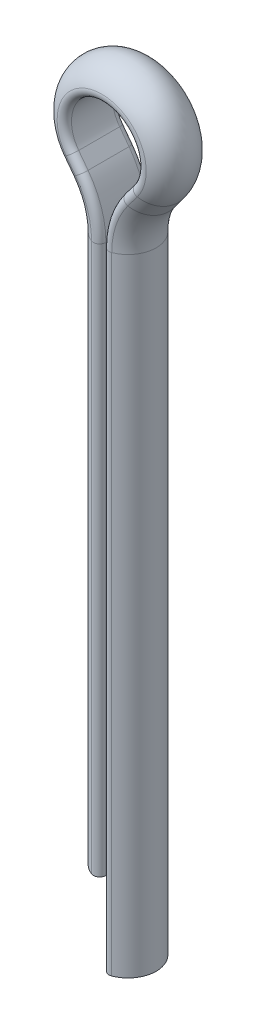
ISO-10303-21;
HEADER;
FILE_DESCRIPTION(('STEP AP214'),'2;1');
FILE_NAME('part.step','',(''),(''),'','','');
FILE_SCHEMA(('AUTOMOTIVE_DESIGN { 1 0 10303 214 1 1 1 1 }'));
ENDSEC;
DATA;
#1=APPLICATION_CONTEXT('core data for automotive mechanical design processes');
#2=APPLICATION_PROTOCOL_DEFINITION('international standard','automotive_design',2000,#1);
#3=PRODUCT_CONTEXT('',#1,'mechanical');
#4=PRODUCT('Part','Part','',(#3));
#5=PRODUCT_RELATED_PRODUCT_CATEGORY('part','',(#4));
#6=PRODUCT_DEFINITION_FORMATION('','',#4);
#7=PRODUCT_DEFINITION_CONTEXT('part definition',#1,'design');
#8=PRODUCT_DEFINITION('design','',#6,#7);
#9=PRODUCT_DEFINITION_SHAPE('','',#8);
#10=(LENGTH_UNIT() NAMED_UNIT(*) SI_UNIT(.MILLI.,.METRE.));
#11=(NAMED_UNIT(*) PLANE_ANGLE_UNIT() SI_UNIT($,.RADIAN.));
#12=(NAMED_UNIT(*) SI_UNIT($,.STERADIAN.) SOLID_ANGLE_UNIT());
#13=UNCERTAINTY_MEASURE_WITH_UNIT(LENGTH_MEASURE(1.E-05),#10,'distance_accuracy_value','');
#14=(GEOMETRIC_REPRESENTATION_CONTEXT(3) GLOBAL_UNCERTAINTY_ASSIGNED_CONTEXT((#13)) GLOBAL_UNIT_ASSIGNED_CONTEXT((#10,
#11,#12)) REPRESENTATION_CONTEXT('',''));
#15=CARTESIAN_POINT('',(0.,0.,0.));
#16=DIRECTION('',(0.,0.,1.));
#17=DIRECTION('',(1.,0.,0.));
#18=AXIS2_PLACEMENT_3D('',#15,#16,#17);
#19=CARTESIAN_POINT('',(0.,-2.5,0.));
#20=DIRECTION('',(0.,-1.,0.));
#21=DIRECTION('',(0.,0.,1.));
#22=AXIS2_PLACEMENT_3D('',#19,#20,#21);
#23=PLANE('',#22);
#24=DIRECTION('',(0.,0.,-1.));
#25=VECTOR('',#24,1.);
#26=CARTESIAN_POINT('',(0.0500000000000002,-2.5,-0.898610037780571));
#27=LINE('',#26,#25);
#28=CARTESIAN_POINT('',(0.0500000000000002,-2.5,0.653834841531101));
#29=VERTEX_POINT('',#28);
#30=CARTESIAN_POINT('',(0.0500000000000002,-2.5,-0.653834841531101));
#31=VERTEX_POINT('',#30);
#32=EDGE_CURVE('E161',#29,#31,#27,.T.);
#33=ORIENTED_EDGE('',*,*,#32,.T.);
#34=CARTESIAN_POINT('',(0.25,-2.5,-0.653834841531101));
#35=DIRECTION('',(0.,-1.,0.));
#36=DIRECTION('',(1.,0.,0.));
#37=AXIS2_PLACEMENT_3D('',#34,#35,#36);
#38=CIRCLE('',#37,0.2);
#39=CARTESIAN_POINT('',(0.321428571428572,-2.5,-0.840644796254273));
#40=VERTEX_POINT('',#39);
#41=EDGE_CURVE('E156',#31,#40,#38,.T.);
#42=ORIENTED_EDGE('',*,*,#41,.T.);
#43=CARTESIAN_POINT('',(0.,-2.5,0.));
#44=DIRECTION('',(0.,-1.,0.));
#45=DIRECTION('',(0.,0.,1.));
#46=AXIS2_PLACEMENT_3D('',#43,#44,#45);
#47=CIRCLE('',#46,0.9);
#48=CARTESIAN_POINT('',(0.321428571428572,-2.5,0.840644796254273));
#49=VERTEX_POINT('',#48);
#50=EDGE_CURVE('E158',#40,#49,#47,.T.);
#51=ORIENTED_EDGE('',*,*,#50,.T.);
#52=CARTESIAN_POINT('',(0.25,-2.5,0.653834841531101));
#53=DIRECTION('',(0.,-1.,0.));
#54=DIRECTION('',(1.,0.,0.));
#55=AXIS2_PLACEMENT_3D('',#52,#53,#54);
#56=CIRCLE('',#55,0.2);
#57=EDGE_CURVE('E167',#49,#29,#56,.T.);
#58=ORIENTED_EDGE('',*,*,#57,.T.);
#59=EDGE_LOOP('',(#33,#42,#51,#58));
#60=FACE_BOUND('',#59,.T.);
#61=ADVANCED_FACE('F39',(#60),#23,.T.);
#62=CARTESIAN_POINT('',(0.,0.,0.));
#63=DIRECTION('',(0.,1.,0.));
#64=DIRECTION('',(0.,0.,1.));
#65=AXIS2_PLACEMENT_3D('',#62,#63,#64);
#66=PLANE('',#65);
#67=CARTESIAN_POINT('',(0.,0.,0.));
#68=DIRECTION('',(0.,1.,0.));
#69=DIRECTION('',(0.,0.,1.));
#70=AXIS2_PLACEMENT_3D('',#67,#68,#69);
#71=CIRCLE('',#70,0.9);
#72=CARTESIAN_POINT('',(-0.321428571428571,0.,-0.840644796254273));
#73=VERTEX_POINT('',#72);
#74=CARTESIAN_POINT('',(-0.321428571428571,0.,0.840644796254273));
#75=VERTEX_POINT('',#74);
#76=EDGE_CURVE('E326',#73,#75,#71,.T.);
#77=ORIENTED_EDGE('',*,*,#76,.F.);
#78=CARTESIAN_POINT('',(-0.25,0.,-0.653834841531101));
#79=DIRECTION('',(0.,1.,0.));
#80=DIRECTION('',(0.,0.,1.));
#81=AXIS2_PLACEMENT_3D('',#78,#79,#80);
#82=CIRCLE('',#81,0.2);
#83=CARTESIAN_POINT('',(-0.0499999999999999,0.,-0.653834841531101));
#84=VERTEX_POINT('',#83);
#85=EDGE_CURVE('E57',#73,#84,#82,.F.);
#86=ORIENTED_EDGE('',*,*,#85,.T.);
#87=DIRECTION('',(0.,0.,-1.));
#88=VECTOR('',#87,1.);
#89=CARTESIAN_POINT('',(-0.0499999999999999,0.,-0.898610037780571));
#90=LINE('',#89,#88);
#91=CARTESIAN_POINT('',(-0.0499999999999999,0.,0.653834841531101));
#92=VERTEX_POINT('',#91);
#93=EDGE_CURVE('E192',#92,#84,#90,.T.);
#94=ORIENTED_EDGE('',*,*,#93,.F.);
#95=CARTESIAN_POINT('',(-0.25,0.,0.653834841531101));
#96=DIRECTION('',(0.,1.,0.));
#97=DIRECTION('',(0.,0.,1.));
#98=AXIS2_PLACEMENT_3D('',#95,#96,#97);
#99=CIRCLE('',#98,0.2);
#100=EDGE_CURVE('E265',#92,#75,#99,.F.);
#101=ORIENTED_EDGE('',*,*,#100,.T.);
#102=EDGE_LOOP('',(#77,#86,#94,#101));
#103=FACE_BOUND('',#102,.T.);
#104=ADVANCED_FACE('F325',(#103),#66,.F.);
#105=CARTESIAN_POINT('',(0.,-2.5,0.));
#106=DIRECTION('',(0.,1.,0.));
#107=DIRECTION('',(-1.,0.,0.));
#108=AXIS2_PLACEMENT_3D('',#105,#106,#107);
#109=CYLINDRICAL_SURFACE('',#108,0.9);
#110=ORIENTED_EDGE('',*,*,#50,.F.);
#111=DIRECTION('',(0.,1.,0.));
#112=VECTOR('',#111,1.);
#113=CARTESIAN_POINT('',(0.321428571428572,-2.5,-0.840644796254273));
#114=LINE('',#113,#112);
#115=CARTESIAN_POINT('',(0.321428571428575,17.5,-0.84064479625427));
#116=VERTEX_POINT('',#115);
#117=EDGE_CURVE('E173',#40,#116,#114,.T.);
#118=ORIENTED_EDGE('',*,*,#117,.T.);
#119=CARTESIAN_POINT('',(0.,17.5,0.));
#120=DIRECTION('',(0.,-1.,0.));
#121=DIRECTION('',(0.,0.,1.));
#122=AXIS2_PLACEMENT_3D('',#119,#120,#121);
#123=CIRCLE('',#122,0.9);
#124=CARTESIAN_POINT('',(0.321428571428589,17.5,0.840644796254258));
#125=VERTEX_POINT('',#124);
#126=EDGE_CURVE('E345',#116,#125,#123,.T.);
#127=ORIENTED_EDGE('',*,*,#126,.T.);
#128=DIRECTION('',(0.,1.,0.));
#129=VECTOR('',#128,1.);
#130=CARTESIAN_POINT('',(0.321428571428572,-2.5,0.840644796254273));
#131=LINE('',#130,#129);
#132=EDGE_CURVE('E176',#125,#49,#131,.F.);
#133=ORIENTED_EDGE('',*,*,#132,.T.);
#134=EDGE_LOOP('',(#110,#118,#127,#133));
#135=FACE_BOUND('',#134,.T.);
#136=ADVANCED_FACE('F171',(#135),#109,.T.);
#137=CARTESIAN_POINT('',(0.0500000000000002,-2.5,-0.898610037780571));
#138=DIRECTION('',(1.,0.,0.));
#139=DIRECTION('',(0.,1.,0.));
#140=AXIS2_PLACEMENT_3D('',#137,#138,#139);
#141=PLANE('',#140);
#142=DIRECTION('',(0.,0.,-1.));
#143=VECTOR('',#142,1.);
#144=CARTESIAN_POINT('',(0.0500000000000001,17.5,-0.898610037780571));
#145=LINE('',#144,#143);
#146=CARTESIAN_POINT('',(0.0500000000000001,17.5,0.653834841531101));
#147=VERTEX_POINT('',#146);
#148=CARTESIAN_POINT('',(0.0500000000000001,17.5,-0.653834841531101));
#149=VERTEX_POINT('',#148);
#150=EDGE_CURVE('E346',#147,#149,#145,.T.);
#151=ORIENTED_EDGE('',*,*,#150,.T.);
#152=DIRECTION('',(0.,1.,0.));
#153=VECTOR('',#152,1.);
#154=CARTESIAN_POINT('',(0.0500000000000002,-2.5,-0.653834841531101));
#155=LINE('',#154,#153);
#156=EDGE_CURVE('E190',#149,#31,#155,.F.);
#157=ORIENTED_EDGE('',*,*,#156,.T.);
#158=ORIENTED_EDGE('',*,*,#32,.F.);
#159=DIRECTION('',(0.,1.,0.));
#160=VECTOR('',#159,1.);
#161=CARTESIAN_POINT('',(0.0500000000000002,-2.5,0.653834841531101));
#162=LINE('',#161,#160);
#163=EDGE_CURVE('E185',#29,#147,#162,.T.);
#164=ORIENTED_EDGE('',*,*,#163,.T.);
#165=EDGE_LOOP('',(#151,#157,#158,#164));
#166=FACE_BOUND('',#165,.T.);
#167=ADVANCED_FACE('F402',(#166),#141,.F.);
#168=CARTESIAN_POINT('',(2.9,17.5,0.));
#169=DIRECTION('',(0.,0.,-1.));
#170=DIRECTION('',(-1.,0.,0.));
#171=AXIS2_PLACEMENT_3D('',#168,#169,#170);
#172=TOROIDAL_SURFACE('',#171,2.9,0.9);
#173=ORIENTED_EDGE('',*,*,#126,.F.);
#174=CARTESIAN_POINT('',(2.9,17.5,-0.84064479625427));
#175=DIRECTION('',(0.,0.,1.));
#176=DIRECTION('',(1.,0.,0.));
#177=AXIS2_PLACEMENT_3D('',#174,#175,#176);
#178=CIRCLE('',#177,2.57857142857143);
#179=CARTESIAN_POINT('',(0.837142857142857,19.0471428571429,-0.840644796254273));
#180=VERTEX_POINT('',#179);
#181=EDGE_CURVE('E202',#116,#180,#178,.F.);
#182=ORIENTED_EDGE('',*,*,#181,.T.);
#183=CARTESIAN_POINT('',(0.58,19.24,0.));
#184=DIRECTION('',(-0.6,-0.8,0.));
#185=DIRECTION('',(0.,0.,1.));
#186=AXIS2_PLACEMENT_3D('',#183,#184,#185);
#187=CIRCLE('',#186,0.9);
#188=CARTESIAN_POINT('',(0.837142857142857,19.0471428571429,0.840644796254273));
#189=VERTEX_POINT('',#188);
#190=EDGE_CURVE('E350',#180,#189,#187,.T.);
#191=ORIENTED_EDGE('',*,*,#190,.T.);
#192=CARTESIAN_POINT('',(2.9,17.5,0.840644796254258));
#193=DIRECTION('',(0.,0.,-1.));
#194=DIRECTION('',(-1.,0.,0.));
#195=AXIS2_PLACEMENT_3D('',#192,#193,#194);
#196=CIRCLE('',#195,2.57857142857143);
#197=EDGE_CURVE('E166',#189,#125,#196,.F.);
#198=ORIENTED_EDGE('',*,*,#197,.T.);
#199=EDGE_LOOP('',(#173,#182,#191,#198));
#200=FACE_BOUND('',#199,.T.);
#201=ADVANCED_FACE('F409',(#200),#172,.T.);
#202=CARTESIAN_POINT('',(2.9,17.5,0.));
#203=DIRECTION('',(0.,0.,-1.));
#204=DIRECTION('',(-1.,0.,0.));
#205=AXIS2_PLACEMENT_3D('',#202,#203,#204);
#206=CYLINDRICAL_SURFACE('',#205,2.85);
#207=DIRECTION('',(0.,0.,-1.));
#208=VECTOR('',#207,1.);
#209=CARTESIAN_POINT('',(0.62,19.21,-0.898610037780571));
#210=LINE('',#209,#208);
#211=CARTESIAN_POINT('',(0.62,19.21,0.653834841531101));
#212=VERTEX_POINT('',#211);
#213=CARTESIAN_POINT('',(0.62,19.21,-0.653834841531101));
#214=VERTEX_POINT('',#213);
#215=EDGE_CURVE('E351',#212,#214,#210,.T.);
#216=ORIENTED_EDGE('',*,*,#215,.T.);
#217=CARTESIAN_POINT('',(2.9,17.5,-0.653834841531101));
#218=DIRECTION('',(0.,0.,1.));
#219=DIRECTION('',(1.,0.,0.));
#220=AXIS2_PLACEMENT_3D('',#217,#218,#219);
#221=CIRCLE('',#220,2.85);
#222=EDGE_CURVE('E208',#214,#149,#221,.T.);
#223=ORIENTED_EDGE('',*,*,#222,.T.);
#224=ORIENTED_EDGE('',*,*,#150,.F.);
#225=CARTESIAN_POINT('',(2.9,17.5,0.653834841531101));
#226=DIRECTION('',(0.,0.,1.));
#227=DIRECTION('',(1.,0.,0.));
#228=AXIS2_PLACEMENT_3D('',#225,#226,#227);
#229=CIRCLE('',#228,2.85);
#230=EDGE_CURVE('E205',#147,#212,#229,.F.);
#231=ORIENTED_EDGE('',*,*,#230,.T.);
#232=EDGE_LOOP('',(#216,#223,#224,#231));
#233=FACE_BOUND('',#232,.T.);
#234=ADVANCED_FACE('F403',(#233),#206,.T.);
#235=CARTESIAN_POINT('',(0.580000000000003,19.24,0.));
#236=DIRECTION('',(0.600000000000004,0.799999999999997,0.));
#237=DIRECTION('',(-0.799999999999997,0.600000000000004,0.));
#238=AXIS2_PLACEMENT_3D('',#235,#236,#237);
#239=CYLINDRICAL_SURFACE('',#238,0.9);
#240=ORIENTED_EDGE('',*,*,#190,.F.);
#241=DIRECTION('',(0.600000000000004,0.799999999999997,0.));
#242=VECTOR('',#241,1.);
#243=CARTESIAN_POINT('',(0.837142857142859,19.0471428571429,-0.840644796254273));
#244=LINE('',#243,#242);
#245=CARTESIAN_POINT('',(1.13714285714286,19.4471428571429,-0.840644796254274));
#246=VERTEX_POINT('',#245);
#247=EDGE_CURVE('E214',#180,#246,#244,.T.);
#248=ORIENTED_EDGE('',*,*,#247,.T.);
#249=CARTESIAN_POINT('',(0.880000000000003,19.64,0.));
#250=DIRECTION('',(-0.600000000000004,-0.799999999999997,0.));
#251=DIRECTION('',(0.,0.,1.));
#252=AXIS2_PLACEMENT_3D('',#249,#250,#251);
#253=CIRCLE('',#252,0.9);
#254=CARTESIAN_POINT('',(1.13714285714285,19.4471428571429,0.840644796254274));
#255=VERTEX_POINT('',#254);
#256=EDGE_CURVE('E355',#246,#255,#253,.T.);
#257=ORIENTED_EDGE('',*,*,#256,.T.);
#258=DIRECTION('',(0.600000000000004,0.799999999999997,0.));
#259=VECTOR('',#258,1.);
#260=CARTESIAN_POINT('',(0.837142857142859,19.0471428571429,0.840644796254273));
#261=LINE('',#260,#259);
#262=EDGE_CURVE('E211',#255,#189,#261,.F.);
#263=ORIENTED_EDGE('',*,*,#262,.T.);
#264=EDGE_LOOP('',(#240,#248,#257,#263));
#265=FACE_BOUND('',#264,.T.);
#266=ADVANCED_FACE('F412',(#265),#239,.T.);
#267=CARTESIAN_POINT('',(0.620000000000003,19.21,-0.898610037780571));
#268=DIRECTION('',(0.799999999999997,-0.600000000000004,0.));
#269=DIRECTION('',(0.600000000000004,0.799999999999997,0.));
#270=AXIS2_PLACEMENT_3D('',#267,#268,#269);
#271=PLANE('',#270);
#272=DIRECTION('',(0.,0.,-1.));
#273=VECTOR('',#272,1.);
#274=CARTESIAN_POINT('',(0.920000000000003,19.61,-0.898610037780571));
#275=LINE('',#274,#273);
#276=CARTESIAN_POINT('',(0.920000000000003,19.61,0.653834841531103));
#277=VERTEX_POINT('',#276);
#278=CARTESIAN_POINT('',(0.920000000000003,19.61,-0.653834841531103));
#279=VERTEX_POINT('',#278);
#280=EDGE_CURVE('E356',#277,#279,#275,.T.);
#281=ORIENTED_EDGE('',*,*,#280,.T.);
#282=DIRECTION('',(0.600000000000004,0.799999999999997,0.));
#283=VECTOR('',#282,1.);
#284=CARTESIAN_POINT('',(0.620000000000003,19.21,-0.653834841531101));
#285=LINE('',#284,#283);
#286=EDGE_CURVE('E220',#279,#214,#285,.F.);
#287=ORIENTED_EDGE('',*,*,#286,.T.);
#288=ORIENTED_EDGE('',*,*,#215,.F.);
#289=DIRECTION('',(0.600000000000004,0.799999999999997,0.));
#290=VECTOR('',#289,1.);
#291=CARTESIAN_POINT('',(0.620000000000003,19.21,0.653834841531101));
#292=LINE('',#291,#290);
#293=EDGE_CURVE('E217',#212,#277,#292,.T.);
#294=ORIENTED_EDGE('',*,*,#293,.T.);
#295=EDGE_LOOP('',(#281,#287,#288,#294));
#296=FACE_BOUND('',#295,.T.);
#297=ADVANCED_FACE('F581',(#296),#271,.F.);
#298=CARTESIAN_POINT('',(0.,20.3,0.));
#299=DIRECTION('',(0.,0.,1.));
#300=DIRECTION('',(1.,0.,0.));
#301=AXIS2_PLACEMENT_3D('',#298,#299,#300);
#302=TOROIDAL_SURFACE('',#301,1.1,0.9);
#303=ORIENTED_EDGE('',*,*,#256,.F.);
#304=CARTESIAN_POINT('',(0.,20.3,-0.840644796254274));
#305=DIRECTION('',(0.,0.,1.));
#306=DIRECTION('',(1.,0.,0.));
#307=AXIS2_PLACEMENT_3D('',#304,#305,#306);
#308=CIRCLE('',#307,1.42142857142857);
#309=CARTESIAN_POINT('',(-1.13714285714285,19.4471428571429,-0.840644796254273));
#310=VERTEX_POINT('',#309);
#311=EDGE_CURVE('E226',#246,#310,#308,.T.);
#312=ORIENTED_EDGE('',*,*,#311,.T.);
#313=CARTESIAN_POINT('',(-0.880000000000001,19.64,0.));
#314=DIRECTION('',(-0.6,0.8,0.));
#315=DIRECTION('',(0.,0.,1.));
#316=AXIS2_PLACEMENT_3D('',#313,#314,#315);
#317=CIRCLE('',#316,0.9);
#318=CARTESIAN_POINT('',(-1.13714285714286,19.4471428571429,0.840644796254273));
#319=VERTEX_POINT('',#318);
#320=EDGE_CURVE('E360',#310,#319,#317,.T.);
#321=ORIENTED_EDGE('',*,*,#320,.T.);
#322=CARTESIAN_POINT('',(0.,20.3,0.840644796254274));
#323=DIRECTION('',(0.,0.,-1.));
#324=DIRECTION('',(-1.,0.,0.));
#325=AXIS2_PLACEMENT_3D('',#322,#323,#324);
#326=CIRCLE('',#325,1.42142857142857);
#327=EDGE_CURVE('E223',#319,#255,#326,.T.);
#328=ORIENTED_EDGE('',*,*,#327,.T.);
#329=EDGE_LOOP('',(#303,#312,#321,#328));
#330=FACE_BOUND('',#329,.T.);
#331=ADVANCED_FACE('F426',(#330),#302,.T.);
#332=CARTESIAN_POINT('',(0.,20.3,0.));
#333=DIRECTION('',(0.,0.,1.));
#334=DIRECTION('',(1.,0.,0.));
#335=AXIS2_PLACEMENT_3D('',#332,#333,#334);
#336=CYLINDRICAL_SURFACE('',#335,1.15);
#337=DIRECTION('',(0.,0.,-1.));
#338=VECTOR('',#337,1.);
#339=CARTESIAN_POINT('',(-0.920000000000001,19.61,-0.898610037780571));
#340=LINE('',#339,#338);
#341=CARTESIAN_POINT('',(-0.920000000000001,19.61,0.653834841531101));
#342=VERTEX_POINT('',#341);
#343=CARTESIAN_POINT('',(-0.920000000000001,19.61,-0.653834841531101));
#344=VERTEX_POINT('',#343);
#345=EDGE_CURVE('E361',#342,#344,#340,.T.);
#346=ORIENTED_EDGE('',*,*,#345,.T.);
#347=CARTESIAN_POINT('',(0.,20.3,-0.653834841531103));
#348=DIRECTION('',(0.,0.,-1.));
#349=DIRECTION('',(-1.,0.,0.));
#350=AXIS2_PLACEMENT_3D('',#347,#348,#349);
#351=CIRCLE('',#350,1.15);
#352=EDGE_CURVE('E232',#344,#279,#351,.T.);
#353=ORIENTED_EDGE('',*,*,#352,.T.);
#354=ORIENTED_EDGE('',*,*,#280,.F.);
#355=CARTESIAN_POINT('',(0.,20.3,0.653834841531103));
#356=DIRECTION('',(0.,0.,-1.));
#357=DIRECTION('',(-1.,0.,0.));
#358=AXIS2_PLACEMENT_3D('',#355,#356,#357);
#359=CIRCLE('',#358,1.15);
#360=EDGE_CURVE('E229',#277,#342,#359,.F.);
#361=ORIENTED_EDGE('',*,*,#360,.T.);
#362=EDGE_LOOP('',(#346,#353,#354,#361));
#363=FACE_BOUND('',#362,.T.);
#364=ADVANCED_FACE('F563',(#363),#336,.F.);
#365=CARTESIAN_POINT('',(-0.879999999999999,19.64,0.));
#366=DIRECTION('',(0.600000000000001,-0.799999999999999,0.));
#367=DIRECTION('',(0.799999999999999,0.600000000000001,0.));
#368=AXIS2_PLACEMENT_3D('',#365,#366,#367);
#369=CYLINDRICAL_SURFACE('',#368,0.9);
#370=ORIENTED_EDGE('',*,*,#320,.F.);
#371=DIRECTION('',(0.600000000000001,-0.799999999999999,0.));
#372=VECTOR('',#371,1.);
#373=CARTESIAN_POINT('',(-1.13714285714286,19.4471428571429,-0.840644796254273));
#374=LINE('',#373,#372);
#375=CARTESIAN_POINT('',(-0.837142857142864,19.0471428571429,-0.840644796254265));
#376=VERTEX_POINT('',#375);
#377=EDGE_CURVE('E238',#310,#376,#374,.T.);
#378=ORIENTED_EDGE('',*,*,#377,.T.);
#379=CARTESIAN_POINT('',(-0.580000000000001,19.24,0.));
#380=DIRECTION('',(-0.600000000000001,0.799999999999999,0.));
#381=DIRECTION('',(0.,0.,1.));
#382=AXIS2_PLACEMENT_3D('',#379,#380,#381);
#383=CIRCLE('',#382,0.9);
#384=CARTESIAN_POINT('',(-0.83714285714286,19.0471428571429,0.840644796254271));
#385=VERTEX_POINT('',#384);
#386=EDGE_CURVE('E365',#376,#385,#383,.T.);
#387=ORIENTED_EDGE('',*,*,#386,.T.);
#388=DIRECTION('',(0.600000000000001,-0.799999999999999,0.));
#389=VECTOR('',#388,1.);
#390=CARTESIAN_POINT('',(-1.13714285714286,19.4471428571429,0.840644796254273));
#391=LINE('',#390,#389);
#392=EDGE_CURVE('E235',#385,#319,#391,.F.);
#393=ORIENTED_EDGE('',*,*,#392,.T.);
#394=EDGE_LOOP('',(#370,#378,#387,#393));
#395=FACE_BOUND('',#394,.T.);
#396=ADVANCED_FACE('F429',(#395),#369,.T.);
#397=CARTESIAN_POINT('',(-0.919999999999999,19.61,-0.898610037780571));
#398=DIRECTION('',(-0.799999999999999,-0.600000000000001,0.));
#399=DIRECTION('',(0.600000000000001,-0.799999999999999,0.));
#400=AXIS2_PLACEMENT_3D('',#397,#398,#399);
#401=PLANE('',#400);
#402=DIRECTION('',(0.,0.,-1.));
#403=VECTOR('',#402,1.);
#404=CARTESIAN_POINT('',(-0.620000000000001,19.21,-0.898610037780571));
#405=LINE('',#404,#403);
#406=CARTESIAN_POINT('',(-0.620000000000001,19.21,0.653834841531101));
#407=VERTEX_POINT('',#406);
#408=CARTESIAN_POINT('',(-0.620000000000001,19.21,-0.653834841531102));
#409=VERTEX_POINT('',#408);
#410=EDGE_CURVE('E366',#407,#409,#405,.T.);
#411=ORIENTED_EDGE('',*,*,#410,.T.);
#412=DIRECTION('',(0.600000000000001,-0.799999999999999,0.));
#413=VECTOR('',#412,1.);
#414=CARTESIAN_POINT('',(-0.919999999999999,19.61,-0.653834841531101));
#415=LINE('',#414,#413);
#416=EDGE_CURVE('E244',#409,#344,#415,.F.);
#417=ORIENTED_EDGE('',*,*,#416,.T.);
#418=ORIENTED_EDGE('',*,*,#345,.F.);
#419=DIRECTION('',(0.600000000000001,-0.799999999999999,0.));
#420=VECTOR('',#419,1.);
#421=CARTESIAN_POINT('',(-0.919999999999999,19.61,0.653834841531101));
#422=LINE('',#421,#420);
#423=EDGE_CURVE('E241',#342,#407,#422,.T.);
#424=ORIENTED_EDGE('',*,*,#423,.T.);
#425=EDGE_LOOP('',(#411,#417,#418,#424));
#426=FACE_BOUND('',#425,.T.);
#427=ADVANCED_FACE('F453',(#426),#401,.F.);
#428=CARTESIAN_POINT('',(-2.9,17.5,0.));
#429=DIRECTION('',(0.,0.,-1.));
#430=DIRECTION('',(-1.,0.,0.));
#431=AXIS2_PLACEMENT_3D('',#428,#429,#430);
#432=TOROIDAL_SURFACE('',#431,2.9,0.9);
#433=ORIENTED_EDGE('',*,*,#386,.F.);
#434=CARTESIAN_POINT('',(-2.9,17.5,-0.840644796254265));
#435=DIRECTION('',(0.,0.,1.));
#436=DIRECTION('',(1.,0.,0.));
#437=AXIS2_PLACEMENT_3D('',#434,#435,#436);
#438=CIRCLE('',#437,2.57857142857143);
#439=CARTESIAN_POINT('',(-0.321428571428571,17.5,-0.840644796254273));
#440=VERTEX_POINT('',#439);
#441=EDGE_CURVE('E250',#376,#440,#438,.F.);
#442=ORIENTED_EDGE('',*,*,#441,.T.);
#443=CARTESIAN_POINT('',(0.,17.5,0.));
#444=DIRECTION('',(0.,1.,0.));
#445=DIRECTION('',(0.,0.,1.));
#446=AXIS2_PLACEMENT_3D('',#443,#444,#445);
#447=CIRCLE('',#446,0.9);
#448=CARTESIAN_POINT('',(-0.321428571428571,17.5,0.840644796254273));
#449=VERTEX_POINT('',#448);
#450=EDGE_CURVE('E338',#440,#449,#447,.T.);
#451=ORIENTED_EDGE('',*,*,#450,.T.);
#452=CARTESIAN_POINT('',(-2.9,17.5,0.840644796254271));
#453=DIRECTION('',(0.,0.,-1.));
#454=DIRECTION('',(-1.,0.,0.));
#455=AXIS2_PLACEMENT_3D('',#452,#453,#454);
#456=CIRCLE('',#455,2.57857142857143);
#457=EDGE_CURVE('E247',#449,#385,#456,.F.);
#458=ORIENTED_EDGE('',*,*,#457,.T.);
#459=EDGE_LOOP('',(#433,#442,#451,#458));
#460=FACE_BOUND('',#459,.T.);
#461=ADVANCED_FACE('F439',(#460),#432,.T.);
#462=CARTESIAN_POINT('',(-2.9,17.5,0.));
#463=DIRECTION('',(0.,0.,-1.));
#464=DIRECTION('',(-1.,0.,0.));
#465=AXIS2_PLACEMENT_3D('',#462,#463,#464);
#466=CYLINDRICAL_SURFACE('',#465,2.85);
#467=DIRECTION('',(0.,0.,-1.));
#468=VECTOR('',#467,1.);
#469=CARTESIAN_POINT('',(-0.0499999999999988,17.5,-0.898610037780571));
#470=LINE('',#469,#468);
#471=CARTESIAN_POINT('',(-0.0499999999999988,17.5,0.653834841531101));
#472=VERTEX_POINT('',#471);
#473=CARTESIAN_POINT('',(-0.0499999999999988,17.5,-0.653834841531101));
#474=VERTEX_POINT('',#473);
#475=EDGE_CURVE('E333',#472,#474,#470,.T.);
#476=ORIENTED_EDGE('',*,*,#475,.T.);
#477=CARTESIAN_POINT('',(-2.9,17.5,-0.653834841531102));
#478=DIRECTION('',(0.,0.,1.));
#479=DIRECTION('',(1.,0.,0.));
#480=AXIS2_PLACEMENT_3D('',#477,#478,#479);
#481=CIRCLE('',#480,2.85);
#482=EDGE_CURVE('E256',#474,#409,#481,.T.);
#483=ORIENTED_EDGE('',*,*,#482,.T.);
#484=ORIENTED_EDGE('',*,*,#410,.F.);
#485=CARTESIAN_POINT('',(-2.9,17.5,0.653834841531102));
#486=DIRECTION('',(0.,0.,1.));
#487=DIRECTION('',(1.,0.,0.));
#488=AXIS2_PLACEMENT_3D('',#485,#486,#487);
#489=CIRCLE('',#488,2.85);
#490=EDGE_CURVE('E253',#407,#472,#489,.F.);
#491=ORIENTED_EDGE('',*,*,#490,.T.);
#492=EDGE_LOOP('',(#476,#483,#484,#491));
#493=FACE_BOUND('',#492,.T.);
#494=ADVANCED_FACE('F445',(#493),#466,.T.);
#495=CARTESIAN_POINT('',(0.,17.5,0.));
#496=DIRECTION('',(0.,-1.,0.));
#497=DIRECTION('',(0.,0.,-1.));
#498=AXIS2_PLACEMENT_3D('',#495,#496,#497);
#499=CYLINDRICAL_SURFACE('',#498,0.9);
#500=ORIENTED_EDGE('',*,*,#450,.F.);
#501=DIRECTION('',(0.,-1.,0.));
#502=VECTOR('',#501,1.);
#503=CARTESIAN_POINT('',(-0.321428571428571,17.5,-0.840644796254273));
#504=LINE('',#503,#502);
#505=EDGE_CURVE('E262',#440,#73,#504,.T.);
#506=ORIENTED_EDGE('',*,*,#505,.T.);
#507=ORIENTED_EDGE('',*,*,#76,.T.);
#508=DIRECTION('',(0.,-1.,0.));
#509=VECTOR('',#508,1.);
#510=CARTESIAN_POINT('',(-0.321428571428571,17.5,0.840644796254273));
#511=LINE('',#510,#509);
#512=EDGE_CURVE('E259',#75,#449,#511,.F.);
#513=ORIENTED_EDGE('',*,*,#512,.T.);
#514=EDGE_LOOP('',(#500,#506,#507,#513));
#515=FACE_BOUND('',#514,.T.);
#516=ADVANCED_FACE('F329',(#515),#499,.T.);
#517=CARTESIAN_POINT('',(-0.0499999999999999,17.5,-0.898610037780571));
#518=DIRECTION('',(-1.,0.,0.));
#519=DIRECTION('',(0.,0.,1.));
#520=AXIS2_PLACEMENT_3D('',#517,#518,#519);
#521=PLANE('',#520);
#522=ORIENTED_EDGE('',*,*,#93,.T.);
#523=DIRECTION('',(0.,-1.,0.));
#524=VECTOR('',#523,1.);
#525=CARTESIAN_POINT('',(-0.0499999999999999,17.5,-0.653834841531101));
#526=LINE('',#525,#524);
#527=EDGE_CURVE('E11',#84,#474,#526,.F.);
#528=ORIENTED_EDGE('',*,*,#527,.T.);
#529=ORIENTED_EDGE('',*,*,#475,.F.);
#530=DIRECTION('',(0.,-1.,0.));
#531=VECTOR('',#530,1.);
#532=CARTESIAN_POINT('',(-0.0499999999999999,17.5,0.653834841531101));
#533=LINE('',#532,#531);
#534=EDGE_CURVE('E49',#472,#92,#533,.T.);
#535=ORIENTED_EDGE('',*,*,#534,.T.);
#536=EDGE_LOOP('',(#522,#528,#529,#535));
#537=FACE_BOUND('',#536,.T.);
#538=ADVANCED_FACE('F443',(#537),#521,.F.);
#539=CARTESIAN_POINT('',(-0.25,17.5,-0.653834841531101));
#540=DIRECTION('',(0.,-1.,0.));
#541=DIRECTION('',(0.,0.,-1.));
#542=AXIS2_PLACEMENT_3D('',#539,#540,#541);
#543=CYLINDRICAL_SURFACE('',#542,0.2);
#544=ORIENTED_EDGE('',*,*,#85,.F.);
#545=ORIENTED_EDGE('',*,*,#505,.F.);
#546=CARTESIAN_POINT('',(-0.25,17.5,-0.653834841531101));
#547=DIRECTION('',(0.,1.,0.));
#548=DIRECTION('',(0.,0.,1.));
#549=AXIS2_PLACEMENT_3D('',#546,#547,#548);
#550=CIRCLE('',#549,0.2);
#551=EDGE_CURVE('E178',#474,#440,#550,.T.);
#552=ORIENTED_EDGE('',*,*,#551,.F.);
#553=ORIENTED_EDGE('',*,*,#527,.F.);
#554=EDGE_LOOP('',(#544,#545,#552,#553));
#555=FACE_BOUND('',#554,.T.);
#556=ADVANCED_FACE('F441',(#555),#543,.T.);
#557=CARTESIAN_POINT('',(-2.9,17.5,-0.653834841531102));
#558=DIRECTION('',(0.,0.,1.));
#559=DIRECTION('',(1.,0.,0.));
#560=AXIS2_PLACEMENT_3D('',#557,#558,#559);
#561=TOROIDAL_SURFACE('',#560,2.65,0.2);
#562=ORIENTED_EDGE('',*,*,#551,.T.);
#563=ORIENTED_EDGE('',*,*,#441,.F.);
#564=CARTESIAN_POINT('',(-0.780000000000002,19.09,-0.653834841531102));
#565=DIRECTION('',(-0.600000000000007,0.799999999999994,0.));
#566=DIRECTION('',(-0.799999999999995,-0.600000000000007,0.));
#567=AXIS2_PLACEMENT_3D('',#564,#565,#566);
#568=CIRCLE('',#567,0.2);
#569=EDGE_CURVE('E286',#409,#376,#568,.T.);
#570=ORIENTED_EDGE('',*,*,#569,.F.);
#571=ORIENTED_EDGE('',*,*,#482,.F.);
#572=EDGE_LOOP('',(#562,#563,#570,#571));
#573=FACE_BOUND('',#572,.T.);
#574=ADVANCED_FACE('F436',(#573),#561,.T.);
#575=CARTESIAN_POINT('',(-1.08,19.49,-0.653834841531101));
#576=DIRECTION('',(0.600000000000001,-0.799999999999999,0.));
#577=DIRECTION('',(0.799999999999999,0.600000000000001,0.));
#578=AXIS2_PLACEMENT_3D('',#575,#576,#577);
#579=CYLINDRICAL_SURFACE('',#578,0.2);
#580=ORIENTED_EDGE('',*,*,#569,.T.);
#581=ORIENTED_EDGE('',*,*,#377,.F.);
#582=CARTESIAN_POINT('',(-1.08,19.49,-0.653834841531101));
#583=DIRECTION('',(-0.599999999999996,0.800000000000003,0.));
#584=DIRECTION('',(-0.800000000000003,-0.599999999999996,0.));
#585=AXIS2_PLACEMENT_3D('',#582,#583,#584);
#586=CIRCLE('',#585,0.2);
#587=EDGE_CURVE('E282',#344,#310,#586,.T.);
#588=ORIENTED_EDGE('',*,*,#587,.F.);
#589=ORIENTED_EDGE('',*,*,#416,.F.);
#590=EDGE_LOOP('',(#580,#581,#588,#589));
#591=FACE_BOUND('',#590,.T.);
#592=ADVANCED_FACE('F431',(#591),#579,.T.);
#593=CARTESIAN_POINT('',(0.,20.3,-0.653834841531103));
#594=DIRECTION('',(0.,0.,-1.));
#595=DIRECTION('',(-1.,0.,0.));
#596=AXIS2_PLACEMENT_3D('',#593,#594,#595);
#597=TOROIDAL_SURFACE('',#596,1.35,0.2);
#598=ORIENTED_EDGE('',*,*,#587,.T.);
#599=ORIENTED_EDGE('',*,*,#311,.F.);
#600=CARTESIAN_POINT('',(1.08,19.49,-0.653834841531103));
#601=DIRECTION('',(-0.599999999999994,-0.800000000000004,0.));
#602=DIRECTION('',(0.800000000000004,-0.599999999999994,0.));
#603=AXIS2_PLACEMENT_3D('',#600,#601,#602);
#604=CIRCLE('',#603,0.2);
#605=EDGE_CURVE('E278',#279,#246,#604,.T.);
#606=ORIENTED_EDGE('',*,*,#605,.F.);
#607=ORIENTED_EDGE('',*,*,#352,.F.);
#608=EDGE_LOOP('',(#598,#599,#606,#607));
#609=FACE_BOUND('',#608,.T.);
#610=ADVANCED_FACE('F422',(#609),#597,.T.);
#611=CARTESIAN_POINT('',(0.780000000000002,19.09,-0.653834841531101));
#612=DIRECTION('',(0.600000000000004,0.799999999999997,0.));
#613=DIRECTION('',(-0.799999999999997,0.600000000000004,0.));
#614=AXIS2_PLACEMENT_3D('',#611,#612,#613);
#615=CYLINDRICAL_SURFACE('',#614,0.2);
#616=ORIENTED_EDGE('',*,*,#605,.T.);
#617=ORIENTED_EDGE('',*,*,#247,.F.);
#618=CARTESIAN_POINT('',(0.779999999999999,19.09,-0.653834841531101));
#619=DIRECTION('',(-0.600000000000008,-0.799999999999994,0.));
#620=DIRECTION('',(0.799999999999994,-0.600000000000008,0.));
#621=AXIS2_PLACEMENT_3D('',#618,#619,#620);
#622=CIRCLE('',#621,0.2);
#623=EDGE_CURVE('E274',#214,#180,#622,.T.);
#624=ORIENTED_EDGE('',*,*,#623,.F.);
#625=ORIENTED_EDGE('',*,*,#286,.F.);
#626=EDGE_LOOP('',(#616,#617,#624,#625));
#627=FACE_BOUND('',#626,.T.);
#628=ADVANCED_FACE('F416',(#627),#615,.T.);
#629=CARTESIAN_POINT('',(2.9,17.5,-0.653834841531101));
#630=DIRECTION('',(0.,0.,1.));
#631=DIRECTION('',(1.,0.,0.));
#632=AXIS2_PLACEMENT_3D('',#629,#630,#631);
#633=TOROIDAL_SURFACE('',#632,2.65,0.2);
#634=ORIENTED_EDGE('',*,*,#623,.T.);
#635=ORIENTED_EDGE('',*,*,#181,.F.);
#636=CARTESIAN_POINT('',(0.25,17.5,-0.653834841531101));
#637=DIRECTION('',(0.,-1.,0.));
#638=DIRECTION('',(0.,0.,-1.));
#639=AXIS2_PLACEMENT_3D('',#636,#637,#638);
#640=CIRCLE('',#639,0.2);
#641=EDGE_CURVE('E182',#149,#116,#640,.T.);
#642=ORIENTED_EDGE('',*,*,#641,.F.);
#643=ORIENTED_EDGE('',*,*,#222,.F.);
#644=EDGE_LOOP('',(#634,#635,#642,#643));
#645=FACE_BOUND('',#644,.T.);
#646=ADVANCED_FACE('F407',(#645),#633,.T.);
#647=CARTESIAN_POINT('',(0.25,-2.5,-0.653834841531101));
#648=DIRECTION('',(0.,1.,0.));
#649=DIRECTION('',(-1.,0.,0.));
#650=AXIS2_PLACEMENT_3D('',#647,#648,#649);
#651=CYLINDRICAL_SURFACE('',#650,0.2);
#652=ORIENTED_EDGE('',*,*,#41,.F.);
#653=ORIENTED_EDGE('',*,*,#156,.F.);
#654=ORIENTED_EDGE('',*,*,#641,.T.);
#655=ORIENTED_EDGE('',*,*,#117,.F.);
#656=EDGE_LOOP('',(#652,#653,#654,#655));
#657=FACE_BOUND('',#656,.T.);
#658=ADVANCED_FACE('F180',(#657),#651,.T.);
#659=CARTESIAN_POINT('',(-0.25,17.5,0.653834841531101));
#660=DIRECTION('',(0.,-1.,0.));
#661=DIRECTION('',(0.,0.,-1.));
#662=AXIS2_PLACEMENT_3D('',#659,#660,#661);
#663=CYLINDRICAL_SURFACE('',#662,0.2);
#664=ORIENTED_EDGE('',*,*,#100,.F.);
#665=ORIENTED_EDGE('',*,*,#534,.F.);
#666=CARTESIAN_POINT('',(-0.25,17.5,0.653834841531101));
#667=DIRECTION('',(0.,1.,0.));
#668=DIRECTION('',(0.,0.,1.));
#669=AXIS2_PLACEMENT_3D('',#666,#667,#668);
#670=CIRCLE('',#669,0.2);
#671=EDGE_CURVE('E43',#449,#472,#670,.T.);
#672=ORIENTED_EDGE('',*,*,#671,.F.);
#673=ORIENTED_EDGE('',*,*,#512,.F.);
#674=EDGE_LOOP('',(#664,#665,#672,#673));
#675=FACE_BOUND('',#674,.T.);
#676=ADVANCED_FACE('F41',(#675),#663,.T.);
#677=CARTESIAN_POINT('',(-2.9,17.5,0.653834841531102));
#678=DIRECTION('',(0.,0.,1.));
#679=DIRECTION('',(1.,0.,0.));
#680=AXIS2_PLACEMENT_3D('',#677,#678,#679);
#681=TOROIDAL_SURFACE('',#680,2.65,0.2);
#682=ORIENTED_EDGE('',*,*,#671,.T.);
#683=ORIENTED_EDGE('',*,*,#490,.F.);
#684=CARTESIAN_POINT('',(-0.780000000000001,19.09,0.653834841531101));
#685=DIRECTION('',(-0.60000000000001,0.799999999999992,0.));
#686=DIRECTION('',(-0.799999999999992,-0.60000000000001,0.));
#687=AXIS2_PLACEMENT_3D('',#684,#685,#686);
#688=CIRCLE('',#687,0.2);
#689=EDGE_CURVE('E307',#385,#407,#688,.T.);
#690=ORIENTED_EDGE('',*,*,#689,.F.);
#691=ORIENTED_EDGE('',*,*,#457,.F.);
#692=EDGE_LOOP('',(#682,#683,#690,#691));
#693=FACE_BOUND('',#692,.T.);
#694=ADVANCED_FACE('F320',(#693),#681,.T.);
#695=CARTESIAN_POINT('',(-1.08,19.49,0.653834841531101));
#696=DIRECTION('',(0.600000000000001,-0.799999999999999,0.));
#697=DIRECTION('',(0.799999999999999,0.600000000000001,0.));
#698=AXIS2_PLACEMENT_3D('',#695,#696,#697);
#699=CYLINDRICAL_SURFACE('',#698,0.2);
#700=ORIENTED_EDGE('',*,*,#689,.T.);
#701=ORIENTED_EDGE('',*,*,#423,.F.);
#702=CARTESIAN_POINT('',(-1.08,19.49,0.653834841531101));
#703=DIRECTION('',(-0.599999999999996,0.800000000000003,0.));
#704=DIRECTION('',(-0.800000000000003,-0.599999999999996,0.));
#705=AXIS2_PLACEMENT_3D('',#702,#703,#704);
#706=CIRCLE('',#705,0.2);
#707=EDGE_CURVE('E304',#319,#342,#706,.T.);
#708=ORIENTED_EDGE('',*,*,#707,.F.);
#709=ORIENTED_EDGE('',*,*,#392,.F.);
#710=EDGE_LOOP('',(#700,#701,#708,#709));
#711=FACE_BOUND('',#710,.T.);
#712=ADVANCED_FACE('F490',(#711),#699,.T.);
#713=CARTESIAN_POINT('',(0.,20.3,0.653834841531103));
#714=DIRECTION('',(0.,0.,-1.));
#715=DIRECTION('',(-1.,0.,0.));
#716=AXIS2_PLACEMENT_3D('',#713,#714,#715);
#717=TOROIDAL_SURFACE('',#716,1.35,0.2);
#718=ORIENTED_EDGE('',*,*,#707,.T.);
#719=ORIENTED_EDGE('',*,*,#360,.F.);
#720=CARTESIAN_POINT('',(1.08,19.49,0.653834841531102));
#721=DIRECTION('',(-0.600000000000014,-0.799999999999989,0.));
#722=DIRECTION('',(0.799999999999989,-0.600000000000014,0.));
#723=AXIS2_PLACEMENT_3D('',#720,#721,#722);
#724=CIRCLE('',#723,0.2);
#725=EDGE_CURVE('E300',#255,#277,#724,.T.);
#726=ORIENTED_EDGE('',*,*,#725,.F.);
#727=ORIENTED_EDGE('',*,*,#327,.F.);
#728=EDGE_LOOP('',(#718,#719,#726,#727));
#729=FACE_BOUND('',#728,.T.);
#730=ADVANCED_FACE('F486',(#729),#717,.T.);
#731=CARTESIAN_POINT('',(0.780000000000002,19.09,0.653834841531101));
#732=DIRECTION('',(0.600000000000004,0.799999999999997,0.));
#733=DIRECTION('',(-0.799999999999997,0.600000000000004,0.));
#734=AXIS2_PLACEMENT_3D('',#731,#732,#733);
#735=CYLINDRICAL_SURFACE('',#734,0.2);
#736=ORIENTED_EDGE('',*,*,#725,.T.);
#737=ORIENTED_EDGE('',*,*,#293,.F.);
#738=CARTESIAN_POINT('',(0.78,19.09,0.653834841531101));
#739=DIRECTION('',(-0.600000000000008,-0.799999999999994,0.));
#740=DIRECTION('',(0.799999999999994,-0.600000000000008,0.));
#741=AXIS2_PLACEMENT_3D('',#738,#739,#740);
#742=CIRCLE('',#741,0.2);
#743=EDGE_CURVE('E296',#189,#212,#742,.T.);
#744=ORIENTED_EDGE('',*,*,#743,.F.);
#745=ORIENTED_EDGE('',*,*,#262,.F.);
#746=EDGE_LOOP('',(#736,#737,#744,#745));
#747=FACE_BOUND('',#746,.T.);
#748=ADVANCED_FACE('F483',(#747),#735,.T.);
#749=CARTESIAN_POINT('',(2.9,17.5,0.653834841531101));
#750=DIRECTION('',(0.,0.,1.));
#751=DIRECTION('',(1.,0.,0.));
#752=AXIS2_PLACEMENT_3D('',#749,#750,#751);
#753=TOROIDAL_SURFACE('',#752,2.65,0.2);
#754=ORIENTED_EDGE('',*,*,#743,.T.);
#755=ORIENTED_EDGE('',*,*,#230,.F.);
#756=CARTESIAN_POINT('',(0.250000000000001,17.5,0.653834841531101));
#757=DIRECTION('',(0.,-1.,0.));
#758=DIRECTION('',(0.,0.,-1.));
#759=AXIS2_PLACEMENT_3D('',#756,#757,#758);
#760=CIRCLE('',#759,0.2);
#761=EDGE_CURVE('E293',#125,#147,#760,.T.);
#762=ORIENTED_EDGE('',*,*,#761,.F.);
#763=ORIENTED_EDGE('',*,*,#197,.F.);
#764=EDGE_LOOP('',(#754,#755,#762,#763));
#765=FACE_BOUND('',#764,.T.);
#766=ADVANCED_FACE('F396',(#765),#753,.T.);
#767=CARTESIAN_POINT('',(0.25,-2.5,0.653834841531101));
#768=DIRECTION('',(0.,1.,0.));
#769=DIRECTION('',(-1.,0.,0.));
#770=AXIS2_PLACEMENT_3D('',#767,#768,#769);
#771=CYLINDRICAL_SURFACE('',#770,0.2);
#772=ORIENTED_EDGE('',*,*,#57,.F.);
#773=ORIENTED_EDGE('',*,*,#132,.F.);
#774=ORIENTED_EDGE('',*,*,#761,.T.);
#775=ORIENTED_EDGE('',*,*,#163,.F.);
#776=EDGE_LOOP('',(#772,#773,#774,#775));
#777=FACE_BOUND('',#776,.T.);
#778=ADVANCED_FACE('F391',(#777),#771,.T.);
#779=CLOSED_SHELL('',(#61,#104,#136,#167,#201,#234,#266,#297,#331,#364,#396,#427,#461,#494,#516,
#538,#556,#574,#592,#610,#628,#646,#658,#676,#694,#712,#730,#748,#766,#778));
#780=MANIFOLD_SOLID_BREP('B2',#779);
#781=ADVANCED_BREP_SHAPE_REPRESENTATION('',(#18,#780),#14);
#782=SHAPE_DEFINITION_REPRESENTATION(#9,#781);
ENDSEC;
END-ISO-10303-21;
